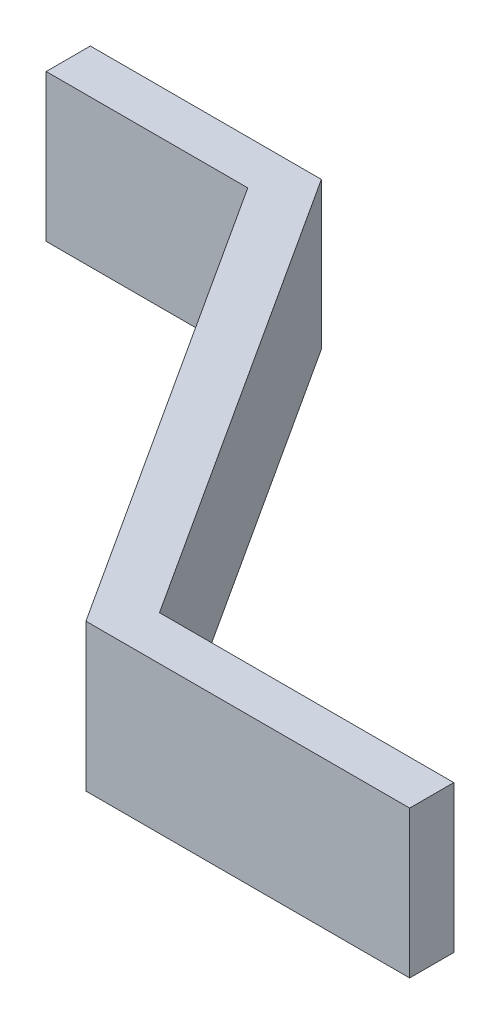
ISO-10303-21;
HEADER;
FILE_DESCRIPTION(('STEP AP214'),'2;1');
FILE_NAME('part.step','',(''),(''),'','','');
FILE_SCHEMA(('AUTOMOTIVE_DESIGN { 1 0 10303 214 1 1 1 1 }'));
ENDSEC;
DATA;
#1=APPLICATION_CONTEXT('core data for automotive mechanical design processes');
#2=APPLICATION_PROTOCOL_DEFINITION('international standard','automotive_design',2000,#1);
#3=PRODUCT_CONTEXT('',#1,'mechanical');
#4=PRODUCT('Part','Part','',(#3));
#5=PRODUCT_RELATED_PRODUCT_CATEGORY('part','',(#4));
#6=PRODUCT_DEFINITION_FORMATION('','',#4);
#7=PRODUCT_DEFINITION_CONTEXT('part definition',#1,'design');
#8=PRODUCT_DEFINITION('design','',#6,#7);
#9=PRODUCT_DEFINITION_SHAPE('','',#8);
#10=(LENGTH_UNIT() NAMED_UNIT(*) SI_UNIT(.MILLI.,.METRE.));
#11=(NAMED_UNIT(*) PLANE_ANGLE_UNIT() SI_UNIT($,.RADIAN.));
#12=(NAMED_UNIT(*) SI_UNIT($,.STERADIAN.) SOLID_ANGLE_UNIT());
#13=UNCERTAINTY_MEASURE_WITH_UNIT(LENGTH_MEASURE(1.E-05),#10,'distance_accuracy_value','');
#14=(GEOMETRIC_REPRESENTATION_CONTEXT(3) GLOBAL_UNCERTAINTY_ASSIGNED_CONTEXT((#13)) GLOBAL_UNIT_ASSIGNED_CONTEXT((#10,
#11,#12)) REPRESENTATION_CONTEXT('',''));
#15=CARTESIAN_POINT('',(0.,0.,0.));
#16=DIRECTION('',(0.,0.,1.));
#17=DIRECTION('',(1.,0.,0.));
#18=AXIS2_PLACEMENT_3D('',#15,#16,#17);
#19=CARTESIAN_POINT('',(0.,-5.,0.));
#20=DIRECTION('',(-0.840296648224244,0.,0.542126869822093));
#21=DIRECTION('',(-0.542126869822093,0.,-0.840296648224244));
#22=AXIS2_PLACEMENT_3D('',#19,#20,#21);
#23=PLANE('',#22);
#24=DIRECTION('',(0.542126869822093,0.,0.840296648224244));
#25=VECTOR('',#24,1.);
#26=CARTESIAN_POINT('',(0.,0.,0.));
#27=LINE('',#26,#25);
#28=CARTESIAN_POINT('',(0.,0.,0.));
#29=VERTEX_POINT('',#28);
#30=CARTESIAN_POINT('',(10.,0.,15.5));
#31=VERTEX_POINT('',#30);
#32=EDGE_CURVE('E11',#29,#31,#27,.T.);
#33=ORIENTED_EDGE('',*,*,#32,.T.);
#34=DIRECTION('',(0.,1.,0.));
#35=VECTOR('',#34,1.);
#36=CARTESIAN_POINT('',(10.,-5.,15.5));
#37=LINE('',#36,#35);
#38=CARTESIAN_POINT('',(10.,-5.,15.5));
#39=VERTEX_POINT('',#38);
#40=EDGE_CURVE('E25',#39,#31,#37,.T.);
#41=ORIENTED_EDGE('',*,*,#40,.F.);
#42=DIRECTION('',(0.542126869822093,0.,0.840296648224244));
#43=VECTOR('',#42,1.);
#44=CARTESIAN_POINT('',(0.,-5.,0.));
#45=LINE('',#44,#43);
#46=CARTESIAN_POINT('',(0.,-5.,0.));
#47=VERTEX_POINT('',#46);
#48=EDGE_CURVE('E186',#47,#39,#45,.T.);
#49=ORIENTED_EDGE('',*,*,#48,.F.);
#50=DIRECTION('',(0.,1.,0.));
#51=VECTOR('',#50,1.);
#52=CARTESIAN_POINT('',(0.,-5.,0.));
#53=LINE('',#52,#51);
#54=EDGE_CURVE('E115',#47,#29,#53,.T.);
#55=ORIENTED_EDGE('',*,*,#54,.T.);
#56=EDGE_LOOP('',(#33,#41,#49,#55));
#57=FACE_BOUND('',#56,.T.);
#58=ADVANCED_FACE('F17',(#57),#23,.F.);
#59=CARTESIAN_POINT('',(10.,-5.,15.5));
#60=DIRECTION('',(0.,0.,1.));
#61=DIRECTION('',(0.,-1.,0.));
#62=AXIS2_PLACEMENT_3D('',#59,#60,#61);
#63=PLANE('',#62);
#64=DIRECTION('',(1.,0.,0.));
#65=VECTOR('',#64,1.);
#66=CARTESIAN_POINT('',(10.,0.,15.5));
#67=LINE('',#66,#65);
#68=CARTESIAN_POINT('',(20.,0.,15.5));
#69=VERTEX_POINT('',#68);
#70=EDGE_CURVE('E181',#31,#69,#67,.T.);
#71=ORIENTED_EDGE('',*,*,#70,.T.);
#72=DIRECTION('',(0.,1.,0.));
#73=VECTOR('',#72,1.);
#74=CARTESIAN_POINT('',(20.,-5.,15.5));
#75=LINE('',#74,#73);
#76=CARTESIAN_POINT('',(20.,-5.,15.5));
#77=VERTEX_POINT('',#76);
#78=EDGE_CURVE('E177',#77,#69,#75,.T.);
#79=ORIENTED_EDGE('',*,*,#78,.F.);
#80=DIRECTION('',(1.,0.,0.));
#81=VECTOR('',#80,1.);
#82=CARTESIAN_POINT('',(10.,-5.,15.5));
#83=LINE('',#82,#81);
#84=EDGE_CURVE('E173',#39,#77,#83,.T.);
#85=ORIENTED_EDGE('',*,*,#84,.F.);
#86=ORIENTED_EDGE('',*,*,#40,.T.);
#87=EDGE_LOOP('',(#71,#79,#85,#86));
#88=FACE_BOUND('',#87,.T.);
#89=ADVANCED_FACE('F192',(#88),#63,.F.);
#90=CARTESIAN_POINT('',(20.,-5.,15.5));
#91=DIRECTION('',(-1.,0.,0.));
#92=DIRECTION('',(0.,-1.,0.));
#93=AXIS2_PLACEMENT_3D('',#90,#91,#92);
#94=PLANE('',#93);
#95=DIRECTION('',(0.,0.,1.));
#96=VECTOR('',#95,1.);
#97=CARTESIAN_POINT('',(20.,0.,15.5));
#98=LINE('',#97,#96);
#99=CARTESIAN_POINT('',(20.,0.,17.));
#100=VERTEX_POINT('',#99);
#101=EDGE_CURVE('E170',#69,#100,#98,.T.);
#102=ORIENTED_EDGE('',*,*,#101,.T.);
#103=DIRECTION('',(0.,1.,0.));
#104=VECTOR('',#103,1.);
#105=CARTESIAN_POINT('',(20.,-5.,17.));
#106=LINE('',#105,#104);
#107=CARTESIAN_POINT('',(20.,-5.,17.));
#108=VERTEX_POINT('',#107);
#109=EDGE_CURVE('E166',#108,#100,#106,.T.);
#110=ORIENTED_EDGE('',*,*,#109,.F.);
#111=DIRECTION('',(0.,0.,1.));
#112=VECTOR('',#111,1.);
#113=CARTESIAN_POINT('',(20.,-5.,15.5));
#114=LINE('',#113,#112);
#115=EDGE_CURVE('E162',#77,#108,#114,.T.);
#116=ORIENTED_EDGE('',*,*,#115,.F.);
#117=ORIENTED_EDGE('',*,*,#78,.T.);
#118=EDGE_LOOP('',(#102,#110,#116,#117));
#119=FACE_BOUND('',#118,.T.);
#120=ADVANCED_FACE('F199',(#119),#94,.F.);
#121=CARTESIAN_POINT('',(20.,-5.,17.));
#122=DIRECTION('',(0.,0.,-1.));
#123=DIRECTION('',(0.,1.,0.));
#124=AXIS2_PLACEMENT_3D('',#121,#122,#123);
#125=PLANE('',#124);
#126=DIRECTION('',(-1.,0.,0.));
#127=VECTOR('',#126,1.);
#128=CARTESIAN_POINT('',(20.,0.,17.));
#129=LINE('',#128,#127);
#130=CARTESIAN_POINT('',(9.,0.,17.));
#131=VERTEX_POINT('',#130);
#132=EDGE_CURVE('E159',#100,#131,#129,.T.);
#133=ORIENTED_EDGE('',*,*,#132,.T.);
#134=DIRECTION('',(0.,1.,0.));
#135=VECTOR('',#134,1.);
#136=CARTESIAN_POINT('',(9.,-5.,17.));
#137=LINE('',#136,#135);
#138=CARTESIAN_POINT('',(9.,-5.,17.));
#139=VERTEX_POINT('',#138);
#140=EDGE_CURVE('E155',#139,#131,#137,.T.);
#141=ORIENTED_EDGE('',*,*,#140,.F.);
#142=DIRECTION('',(-1.,0.,0.));
#143=VECTOR('',#142,1.);
#144=CARTESIAN_POINT('',(20.,-5.,17.));
#145=LINE('',#144,#143);
#146=EDGE_CURVE('E151',#108,#139,#145,.T.);
#147=ORIENTED_EDGE('',*,*,#146,.F.);
#148=ORIENTED_EDGE('',*,*,#109,.T.);
#149=EDGE_LOOP('',(#133,#141,#147,#148));
#150=FACE_BOUND('',#149,.T.);
#151=ADVANCED_FACE('F203',(#150),#125,.F.);
#152=CARTESIAN_POINT('',(9.,-5.,17.));
#153=DIRECTION('',(0.840296648224245,0.,-0.542126869822093));
#154=DIRECTION('',(0.542126869822093,0.,0.840296648224245));
#155=AXIS2_PLACEMENT_3D('',#152,#153,#154);
#156=PLANE('',#155);
#157=DIRECTION('',(-0.542126869822093,0.,-0.840296648224245));
#158=VECTOR('',#157,1.);
#159=CARTESIAN_POINT('',(9.,0.,17.));
#160=LINE('',#159,#158);
#161=CARTESIAN_POINT('',(-1.,0.,1.5));
#162=VERTEX_POINT('',#161);
#163=EDGE_CURVE('E148',#131,#162,#160,.T.);
#164=ORIENTED_EDGE('',*,*,#163,.T.);
#165=DIRECTION('',(0.,1.,0.));
#166=VECTOR('',#165,1.);
#167=CARTESIAN_POINT('',(-1.,-5.,1.5));
#168=LINE('',#167,#166);
#169=CARTESIAN_POINT('',(-1.,-5.,1.5));
#170=VERTEX_POINT('',#169);
#171=EDGE_CURVE('E144',#170,#162,#168,.T.);
#172=ORIENTED_EDGE('',*,*,#171,.F.);
#173=DIRECTION('',(-0.542126869822093,0.,-0.840296648224245));
#174=VECTOR('',#173,1.);
#175=CARTESIAN_POINT('',(9.,-5.,17.));
#176=LINE('',#175,#174);
#177=EDGE_CURVE('E141',#139,#170,#176,.T.);
#178=ORIENTED_EDGE('',*,*,#177,.F.);
#179=ORIENTED_EDGE('',*,*,#140,.T.);
#180=EDGE_LOOP('',(#164,#172,#178,#179));
#181=FACE_BOUND('',#180,.T.);
#182=ADVANCED_FACE('F209',(#181),#156,.F.);
#183=CARTESIAN_POINT('',(-1.,-5.,1.5));
#184=DIRECTION('',(0.,0.,-1.));
#185=DIRECTION('',(1.,0.,0.));
#186=AXIS2_PLACEMENT_3D('',#183,#184,#185);
#187=PLANE('',#186);
#188=DIRECTION('',(-1.,0.,0.));
#189=VECTOR('',#188,1.);
#190=CARTESIAN_POINT('',(-1.,0.,1.5));
#191=LINE('',#190,#189);
#192=CARTESIAN_POINT('',(-7.85,0.,1.5));
#193=VERTEX_POINT('',#192);
#194=EDGE_CURVE('E138',#162,#193,#191,.T.);
#195=ORIENTED_EDGE('',*,*,#194,.T.);
#196=DIRECTION('',(0.,1.,0.));
#197=VECTOR('',#196,1.);
#198=CARTESIAN_POINT('',(-7.85,-5.,1.5));
#199=LINE('',#198,#197);
#200=CARTESIAN_POINT('',(-7.85,-5.,1.5));
#201=VERTEX_POINT('',#200);
#202=EDGE_CURVE('E135',#201,#193,#199,.T.);
#203=ORIENTED_EDGE('',*,*,#202,.F.);
#204=DIRECTION('',(-1.,0.,0.));
#205=VECTOR('',#204,1.);
#206=CARTESIAN_POINT('',(-1.,-5.,1.5));
#207=LINE('',#206,#205);
#208=EDGE_CURVE('E124',#170,#201,#207,.T.);
#209=ORIENTED_EDGE('',*,*,#208,.F.);
#210=ORIENTED_EDGE('',*,*,#171,.T.);
#211=EDGE_LOOP('',(#195,#203,#209,#210));
#212=FACE_BOUND('',#211,.T.);
#213=ADVANCED_FACE('F207',(#212),#187,.F.);
#214=CARTESIAN_POINT('',(-7.85,-5.,0.));
#215=DIRECTION('',(1.,0.,0.));
#216=DIRECTION('',(0.,1.,0.));
#217=AXIS2_PLACEMENT_3D('',#214,#215,#216);
#218=PLANE('',#217);
#219=DIRECTION('',(0.,0.,-1.));
#220=VECTOR('',#219,1.);
#221=CARTESIAN_POINT('',(-7.85,0.,0.));
#222=LINE('',#221,#220);
#223=CARTESIAN_POINT('',(-7.85,0.,0.));
#224=VERTEX_POINT('',#223);
#225=EDGE_CURVE('E105',#193,#224,#222,.T.);
#226=ORIENTED_EDGE('',*,*,#225,.T.);
#227=DIRECTION('',(0.,1.,0.));
#228=VECTOR('',#227,1.);
#229=CARTESIAN_POINT('',(-7.85,-5.,0.));
#230=LINE('',#229,#228);
#231=CARTESIAN_POINT('',(-7.85,-5.,0.));
#232=VERTEX_POINT('',#231);
#233=EDGE_CURVE('E97',#232,#224,#230,.T.);
#234=ORIENTED_EDGE('',*,*,#233,.F.);
#235=DIRECTION('',(0.,0.,-1.));
#236=VECTOR('',#235,1.);
#237=CARTESIAN_POINT('',(-7.85,-5.,0.));
#238=LINE('',#237,#236);
#239=EDGE_CURVE('E102',#201,#232,#238,.T.);
#240=ORIENTED_EDGE('',*,*,#239,.F.);
#241=ORIENTED_EDGE('',*,*,#202,.T.);
#242=EDGE_LOOP('',(#226,#234,#240,#241));
#243=FACE_BOUND('',#242,.T.);
#244=ADVANCED_FACE('F99',(#243),#218,.F.);
#245=CARTESIAN_POINT('',(0.,-5.,0.));
#246=DIRECTION('',(0.,0.,1.));
#247=DIRECTION('',(0.,-1.,0.));
#248=AXIS2_PLACEMENT_3D('',#245,#246,#247);
#249=PLANE('',#248);
#250=DIRECTION('',(1.,0.,0.));
#251=VECTOR('',#250,1.);
#252=CARTESIAN_POINT('',(0.,0.,0.));
#253=LINE('',#252,#251);
#254=EDGE_CURVE('E119',#224,#29,#253,.T.);
#255=ORIENTED_EDGE('',*,*,#254,.T.);
#256=ORIENTED_EDGE('',*,*,#54,.F.);
#257=DIRECTION('',(1.,0.,0.));
#258=VECTOR('',#257,1.);
#259=CARTESIAN_POINT('',(0.,-5.,0.));
#260=LINE('',#259,#258);
#261=EDGE_CURVE('E113',#232,#47,#260,.T.);
#262=ORIENTED_EDGE('',*,*,#261,.F.);
#263=ORIENTED_EDGE('',*,*,#233,.T.);
#264=EDGE_LOOP('',(#255,#256,#262,#263));
#265=FACE_BOUND('',#264,.T.);
#266=ADVANCED_FACE('F114',(#265),#249,.F.);
#267=CARTESIAN_POINT('',(0.,-5.,0.));
#268=DIRECTION('',(0.,1.,0.));
#269=DIRECTION('',(-1.,0.,0.));
#270=AXIS2_PLACEMENT_3D('',#267,#268,#269);
#271=PLANE('',#270);
#272=ORIENTED_EDGE('',*,*,#48,.T.);
#273=ORIENTED_EDGE('',*,*,#84,.T.);
#274=ORIENTED_EDGE('',*,*,#115,.T.);
#275=ORIENTED_EDGE('',*,*,#146,.T.);
#276=ORIENTED_EDGE('',*,*,#177,.T.);
#277=ORIENTED_EDGE('',*,*,#208,.T.);
#278=ORIENTED_EDGE('',*,*,#239,.T.);
#279=ORIENTED_EDGE('',*,*,#261,.T.);
#280=EDGE_LOOP('',(#272,#273,#274,#275,#276,#277,#278,#279));
#281=FACE_BOUND('',#280,.T.);
#282=ADVANCED_FACE('F121',(#281),#271,.F.);
#283=CARTESIAN_POINT('',(0.,0.,0.));
#284=DIRECTION('',(0.,1.,0.));
#285=DIRECTION('',(-1.,0.,0.));
#286=AXIS2_PLACEMENT_3D('',#283,#284,#285);
#287=PLANE('',#286);
#288=ORIENTED_EDGE('',*,*,#32,.F.);
#289=ORIENTED_EDGE('',*,*,#254,.F.);
#290=ORIENTED_EDGE('',*,*,#225,.F.);
#291=ORIENTED_EDGE('',*,*,#194,.F.);
#292=ORIENTED_EDGE('',*,*,#163,.F.);
#293=ORIENTED_EDGE('',*,*,#132,.F.);
#294=ORIENTED_EDGE('',*,*,#101,.F.);
#295=ORIENTED_EDGE('',*,*,#70,.F.);
#296=EDGE_LOOP('',(#288,#289,#290,#291,#292,#293,#294,#295));
#297=FACE_BOUND('',#296,.T.);
#298=ADVANCED_FACE('F195',(#297),#287,.T.);
#299=CLOSED_SHELL('',(#58,#89,#120,#151,#182,#213,#244,#266,#282,#298));
#300=MANIFOLD_SOLID_BREP('B1',#299);
#301=ADVANCED_BREP_SHAPE_REPRESENTATION('',(#18,#300),#14);
#302=SHAPE_DEFINITION_REPRESENTATION(#9,#301);
ENDSEC;
END-ISO-10303-21;
